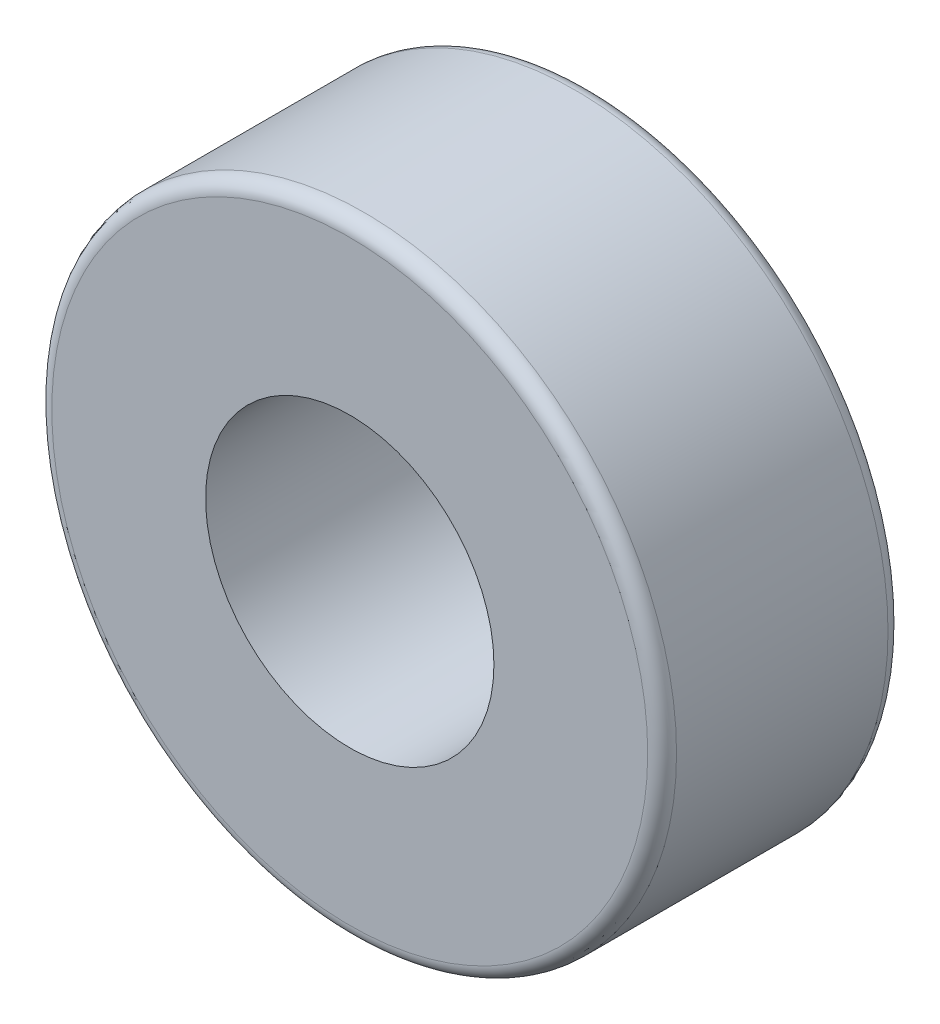
ISO-10303-21;
HEADER;
FILE_DESCRIPTION(('STEP AP214'),'2;1');
FILE_NAME('part.step','',(''),(''),'','','');
FILE_SCHEMA(('AUTOMOTIVE_DESIGN { 1 0 10303 214 1 1 1 1 }'));
ENDSEC;
DATA;
#1=APPLICATION_CONTEXT('core data for automotive mechanical design processes');
#2=APPLICATION_PROTOCOL_DEFINITION('international standard','automotive_design',2000,#1);
#3=PRODUCT_CONTEXT('',#1,'mechanical');
#4=PRODUCT('Part','Part','',(#3));
#5=PRODUCT_RELATED_PRODUCT_CATEGORY('part','',(#4));
#6=PRODUCT_DEFINITION_FORMATION('','',#4);
#7=PRODUCT_DEFINITION_CONTEXT('part definition',#1,'design');
#8=PRODUCT_DEFINITION('design','',#6,#7);
#9=PRODUCT_DEFINITION_SHAPE('','',#8);
#10=(LENGTH_UNIT() NAMED_UNIT(*) SI_UNIT(.MILLI.,.METRE.));
#11=(NAMED_UNIT(*) PLANE_ANGLE_UNIT() SI_UNIT($,.RADIAN.));
#12=(NAMED_UNIT(*) SI_UNIT($,.STERADIAN.) SOLID_ANGLE_UNIT());
#13=UNCERTAINTY_MEASURE_WITH_UNIT(LENGTH_MEASURE(1.E-05),#10,'distance_accuracy_value','');
#14=(GEOMETRIC_REPRESENTATION_CONTEXT(3) GLOBAL_UNCERTAINTY_ASSIGNED_CONTEXT((#13)) GLOBAL_UNIT_ASSIGNED_CONTEXT((#10,
#11,#12)) REPRESENTATION_CONTEXT('',''));
#15=CARTESIAN_POINT('',(0.,0.,0.));
#16=DIRECTION('',(0.,0.,1.));
#17=DIRECTION('',(1.,0.,0.));
#18=AXIS2_PLACEMENT_3D('',#15,#16,#17);
#19=CARTESIAN_POINT('',(0.,0.,5.));
#20=DIRECTION('',(0.,0.,1.));
#21=DIRECTION('',(1.,0.,0.));
#22=AXIS2_PLACEMENT_3D('',#19,#20,#21);
#23=PLANE('',#22);
#24=CARTESIAN_POINT('',(0.,0.,5.));
#25=DIRECTION('',(0.,0.,1.));
#26=DIRECTION('',(1.,0.,0.));
#27=AXIS2_PLACEMENT_3D('',#24,#25,#26);
#28=CIRCLE('',#27,6.2);
#29=CARTESIAN_POINT('',(6.2,0.,5.));
#30=VERTEX_POINT('',#29);
#31=EDGE_CURVE('E55',#30,#30,#28,.T.);
#32=ORIENTED_EDGE('',*,*,#31,.T.);
#33=EDGE_LOOP('',(#32));
#34=FACE_BOUND('',#33,.T.);
#35=CARTESIAN_POINT('',(0.,0.,5.));
#36=DIRECTION('',(0.,0.,1.));
#37=DIRECTION('',(1.,0.,0.));
#38=AXIS2_PLACEMENT_3D('',#35,#36,#37);
#39=CIRCLE('',#38,3.);
#40=CARTESIAN_POINT('',(3.,0.,5.));
#41=VERTEX_POINT('',#40);
#42=EDGE_CURVE('E61',#41,#41,#39,.T.);
#43=ORIENTED_EDGE('',*,*,#42,.F.);
#44=EDGE_LOOP('',(#43));
#45=FACE_BOUND('',#44,.T.);
#46=ADVANCED_FACE('F37',(#34,#45),#23,.T.);
#47=CARTESIAN_POINT('',(0.,0.,0.));
#48=DIRECTION('',(0.,0.,1.));
#49=DIRECTION('',(1.,0.,0.));
#50=AXIS2_PLACEMENT_3D('',#47,#48,#49);
#51=PLANE('',#50);
#52=CARTESIAN_POINT('',(0.,0.,0.));
#53=DIRECTION('',(0.,0.,1.));
#54=DIRECTION('',(1.,0.,0.));
#55=AXIS2_PLACEMENT_3D('',#52,#53,#54);
#56=CIRCLE('',#55,6.2);
#57=CARTESIAN_POINT('',(6.2,0.,0.));
#58=VERTEX_POINT('',#57);
#59=EDGE_CURVE('E10',#58,#58,#56,.F.);
#60=ORIENTED_EDGE('',*,*,#59,.T.);
#61=EDGE_LOOP('',(#60));
#62=FACE_BOUND('',#61,.T.);
#63=CARTESIAN_POINT('',(0.,0.,0.));
#64=DIRECTION('',(0.,0.,1.));
#65=DIRECTION('',(1.,0.,0.));
#66=AXIS2_PLACEMENT_3D('',#63,#64,#65);
#67=CIRCLE('',#66,3.);
#68=CARTESIAN_POINT('',(3.,0.,0.));
#69=VERTEX_POINT('',#68);
#70=EDGE_CURVE('E62',#69,#69,#67,.T.);
#71=ORIENTED_EDGE('',*,*,#70,.T.);
#72=EDGE_LOOP('',(#71));
#73=FACE_BOUND('',#72,.T.);
#74=ADVANCED_FACE('F74',(#62,#73),#51,.F.);
#75=CARTESIAN_POINT('',(0.,0.,5.));
#76=DIRECTION('',(0.,0.,-1.));
#77=DIRECTION('',(-1.,0.,0.));
#78=AXIS2_PLACEMENT_3D('',#75,#76,#77);
#79=CYLINDRICAL_SURFACE('',#78,6.5);
#80=CARTESIAN_POINT('',(0.,0.,4.7));
#81=DIRECTION('',(0.,0.,1.));
#82=DIRECTION('',(1.,0.,0.));
#83=AXIS2_PLACEMENT_3D('',#80,#81,#82);
#84=CIRCLE('',#83,6.5);
#85=CARTESIAN_POINT('',(6.5,0.,4.7));
#86=VERTEX_POINT('',#85);
#87=EDGE_CURVE('E45',#86,#86,#84,.F.);
#88=ORIENTED_EDGE('',*,*,#87,.T.);
#89=EDGE_LOOP('',(#88));
#90=FACE_BOUND('',#89,.T.);
#91=CARTESIAN_POINT('',(0.,0.,0.3));
#92=DIRECTION('',(0.,0.,1.));
#93=DIRECTION('',(1.,0.,0.));
#94=AXIS2_PLACEMENT_3D('',#91,#92,#93);
#95=CIRCLE('',#94,6.5);
#96=CARTESIAN_POINT('',(6.5,0.,0.3));
#97=VERTEX_POINT('',#96);
#98=EDGE_CURVE('E50',#97,#97,#95,.T.);
#99=ORIENTED_EDGE('',*,*,#98,.T.);
#100=EDGE_LOOP('',(#99));
#101=FACE_BOUND('',#100,.T.);
#102=ADVANCED_FACE('F80',(#90,#101),#79,.T.);
#103=CARTESIAN_POINT('',(0.,0.,5.));
#104=DIRECTION('',(0.,0.,-1.));
#105=DIRECTION('',(-1.,0.,0.));
#106=AXIS2_PLACEMENT_3D('',#103,#104,#105);
#107=CYLINDRICAL_SURFACE('',#106,3.);
#108=ORIENTED_EDGE('',*,*,#42,.T.);
#109=EDGE_LOOP('',(#108));
#110=FACE_BOUND('',#109,.T.);
#111=ORIENTED_EDGE('',*,*,#70,.F.);
#112=EDGE_LOOP('',(#111));
#113=FACE_BOUND('',#112,.T.);
#114=ADVANCED_FACE('F70',(#110,#113),#107,.F.);
#115=CARTESIAN_POINT('',(0.,0.,4.7));
#116=DIRECTION('',(0.,0.,1.));
#117=DIRECTION('',(1.,0.,0.));
#118=AXIS2_PLACEMENT_3D('',#115,#116,#117);
#119=TOROIDAL_SURFACE('',#118,6.2,0.3);
#120=ORIENTED_EDGE('',*,*,#87,.F.);
#121=EDGE_LOOP('',(#120));
#122=FACE_BOUND('',#121,.T.);
#123=ORIENTED_EDGE('',*,*,#31,.F.);
#124=EDGE_LOOP('',(#123));
#125=FACE_BOUND('',#124,.T.);
#126=ADVANCED_FACE('F85',(#122,#125),#119,.T.);
#127=CARTESIAN_POINT('',(0.,0.,0.3));
#128=DIRECTION('',(0.,0.,1.));
#129=DIRECTION('',(1.,0.,0.));
#130=AXIS2_PLACEMENT_3D('',#127,#128,#129);
#131=TOROIDAL_SURFACE('',#130,6.2,0.3);
#132=ORIENTED_EDGE('',*,*,#59,.F.);
#133=EDGE_LOOP('',(#132));
#134=FACE_BOUND('',#133,.T.);
#135=ORIENTED_EDGE('',*,*,#98,.F.);
#136=EDGE_LOOP('',(#135));
#137=FACE_BOUND('',#136,.T.);
#138=ADVANCED_FACE('F39',(#134,#137),#131,.T.);
#139=CLOSED_SHELL('',(#46,#74,#102,#114,#126,#138));
#140=MANIFOLD_SOLID_BREP('B2',#139);
#141=ADVANCED_BREP_SHAPE_REPRESENTATION('',(#18,#140),#14);
#142=SHAPE_DEFINITION_REPRESENTATION(#9,#141);
ENDSEC;
END-ISO-10303-21;
